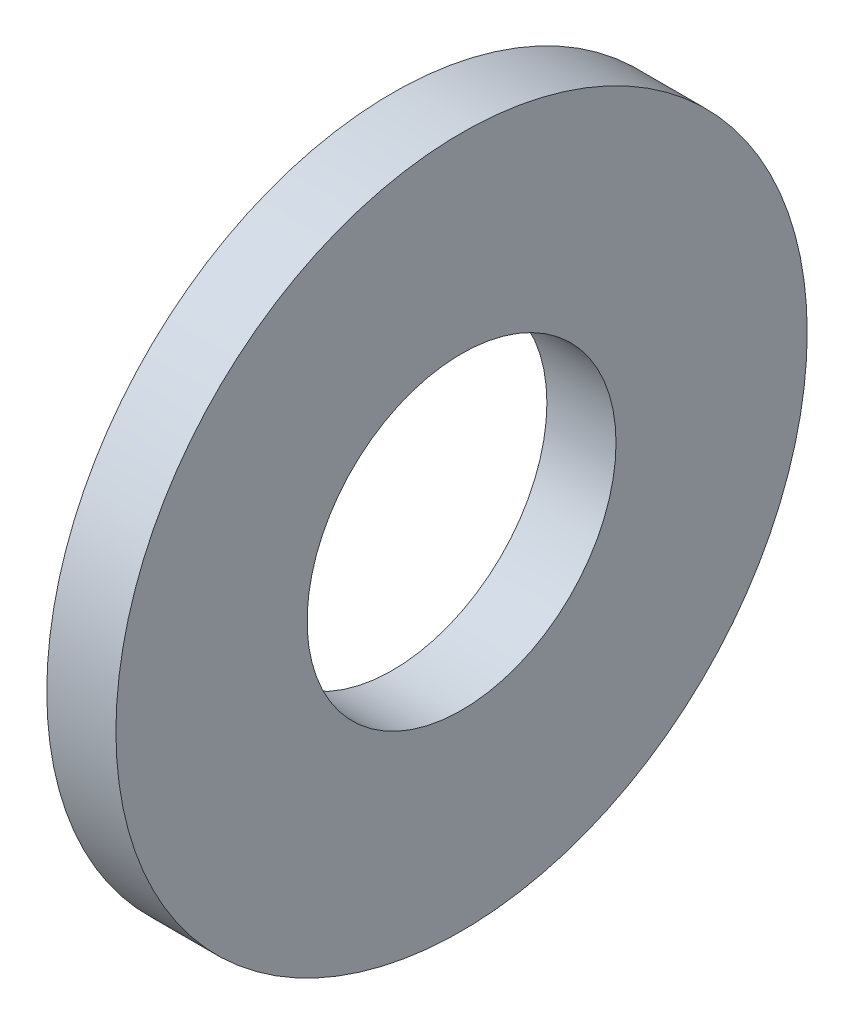
ISO-10303-21;
HEADER;
FILE_DESCRIPTION(('STEP AP214'),'2;1');
FILE_NAME('part.step','',(''),(''),'','','');
FILE_SCHEMA(('AUTOMOTIVE_DESIGN { 1 0 10303 214 1 1 1 1 }'));
ENDSEC;
DATA;
#1=APPLICATION_CONTEXT('core data for automotive mechanical design processes');
#2=APPLICATION_PROTOCOL_DEFINITION('international standard','automotive_design',2000,#1);
#3=PRODUCT_CONTEXT('',#1,'mechanical');
#4=PRODUCT('Part','Part','',(#3));
#5=PRODUCT_RELATED_PRODUCT_CATEGORY('part','',(#4));
#6=PRODUCT_DEFINITION_FORMATION('','',#4);
#7=PRODUCT_DEFINITION_CONTEXT('part definition',#1,'design');
#8=PRODUCT_DEFINITION('design','',#6,#7);
#9=PRODUCT_DEFINITION_SHAPE('','',#8);
#10=(LENGTH_UNIT() NAMED_UNIT(*) SI_UNIT(.MILLI.,.METRE.));
#11=(NAMED_UNIT(*) PLANE_ANGLE_UNIT() SI_UNIT($,.RADIAN.));
#12=(NAMED_UNIT(*) SI_UNIT($,.STERADIAN.) SOLID_ANGLE_UNIT());
#13=UNCERTAINTY_MEASURE_WITH_UNIT(LENGTH_MEASURE(1.E-05),#10,'distance_accuracy_value','');
#14=(GEOMETRIC_REPRESENTATION_CONTEXT(3) GLOBAL_UNCERTAINTY_ASSIGNED_CONTEXT((#13)) GLOBAL_UNIT_ASSIGNED_CONTEXT((#10,
#11,#12)) REPRESENTATION_CONTEXT('',''));
#15=CARTESIAN_POINT('',(0.,0.,0.));
#16=DIRECTION('',(0.,0.,1.));
#17=DIRECTION('',(1.,0.,0.));
#18=AXIS2_PLACEMENT_3D('',#15,#16,#17);
#19=CARTESIAN_POINT('',(1.6,0.,0.));
#20=DIRECTION('',(1.,0.,0.));
#21=DIRECTION('',(0.,0.,-1.));
#22=AXIS2_PLACEMENT_3D('',#19,#20,#21);
#23=PLANE('',#22);
#24=CARTESIAN_POINT('',(1.6,0.,0.));
#25=DIRECTION('',(1.,0.,0.));
#26=DIRECTION('',(0.,0.,-1.));
#27=AXIS2_PLACEMENT_3D('',#24,#25,#26);
#28=CIRCLE('',#27,8.);
#29=CARTESIAN_POINT('',(1.6,0.,-8.));
#30=VERTEX_POINT('',#29);
#31=EDGE_CURVE('E10',#30,#30,#28,.T.);
#32=ORIENTED_EDGE('',*,*,#31,.T.);
#33=EDGE_LOOP('',(#32));
#34=FACE_BOUND('',#33,.T.);
#35=CARTESIAN_POINT('',(1.6,0.,0.));
#36=DIRECTION('',(1.,0.,0.));
#37=DIRECTION('',(0.,0.,-1.));
#38=AXIS2_PLACEMENT_3D('',#35,#36,#37);
#39=CIRCLE('',#38,3.575);
#40=CARTESIAN_POINT('',(1.6,0.,-3.575));
#41=VERTEX_POINT('',#40);
#42=EDGE_CURVE('E43',#41,#41,#39,.T.);
#43=ORIENTED_EDGE('',*,*,#42,.F.);
#44=EDGE_LOOP('',(#43));
#45=FACE_BOUND('',#44,.T.);
#46=ADVANCED_FACE('F32',(#34,#45),#23,.T.);
#47=CARTESIAN_POINT('',(0.,0.,0.));
#48=DIRECTION('',(1.,0.,0.));
#49=DIRECTION('',(0.,0.,-1.));
#50=AXIS2_PLACEMENT_3D('',#47,#48,#49);
#51=PLANE('',#50);
#52=CARTESIAN_POINT('',(0.,0.,0.));
#53=DIRECTION('',(1.,0.,0.));
#54=DIRECTION('',(0.,0.,-1.));
#55=AXIS2_PLACEMENT_3D('',#52,#53,#54);
#56=CIRCLE('',#55,8.);
#57=CARTESIAN_POINT('',(0.,0.,-8.));
#58=VERTEX_POINT('',#57);
#59=EDGE_CURVE('E36',#58,#58,#56,.T.);
#60=ORIENTED_EDGE('',*,*,#59,.F.);
#61=EDGE_LOOP('',(#60));
#62=FACE_BOUND('',#61,.T.);
#63=CARTESIAN_POINT('',(0.,0.,0.));
#64=DIRECTION('',(1.,0.,0.));
#65=DIRECTION('',(0.,0.,-1.));
#66=AXIS2_PLACEMENT_3D('',#63,#64,#65);
#67=CIRCLE('',#66,3.575);
#68=CARTESIAN_POINT('',(0.,0.,-3.575));
#69=VERTEX_POINT('',#68);
#70=EDGE_CURVE('E45',#69,#69,#67,.T.);
#71=ORIENTED_EDGE('',*,*,#70,.T.);
#72=EDGE_LOOP('',(#71));
#73=FACE_BOUND('',#72,.T.);
#74=ADVANCED_FACE('F55',(#62,#73),#51,.F.);
#75=CARTESIAN_POINT('',(1.6,0.,0.));
#76=DIRECTION('',(-1.,0.,0.));
#77=DIRECTION('',(0.,0.,1.));
#78=AXIS2_PLACEMENT_3D('',#75,#76,#77);
#79=CYLINDRICAL_SURFACE('',#78,8.);
#80=ORIENTED_EDGE('',*,*,#31,.F.);
#81=EDGE_LOOP('',(#80));
#82=FACE_BOUND('',#81,.T.);
#83=ORIENTED_EDGE('',*,*,#59,.T.);
#84=EDGE_LOOP('',(#83));
#85=FACE_BOUND('',#84,.T.);
#86=ADVANCED_FACE('F34',(#82,#85),#79,.T.);
#87=CARTESIAN_POINT('',(1.6,0.,0.));
#88=DIRECTION('',(-1.,0.,0.));
#89=DIRECTION('',(0.,0.,1.));
#90=AXIS2_PLACEMENT_3D('',#87,#88,#89);
#91=CYLINDRICAL_SURFACE('',#90,3.575);
#92=ORIENTED_EDGE('',*,*,#42,.T.);
#93=EDGE_LOOP('',(#92));
#94=FACE_BOUND('',#93,.T.);
#95=ORIENTED_EDGE('',*,*,#70,.F.);
#96=EDGE_LOOP('',(#95));
#97=FACE_BOUND('',#96,.T.);
#98=ADVANCED_FACE('F51',(#94,#97),#91,.F.);
#99=CLOSED_SHELL('',(#46,#74,#86,#98));
#100=MANIFOLD_SOLID_BREP('B2',#99);
#101=ADVANCED_BREP_SHAPE_REPRESENTATION('',(#18,#100),#14);
#102=SHAPE_DEFINITION_REPRESENTATION(#9,#101);
ENDSEC;
END-ISO-10303-21;
